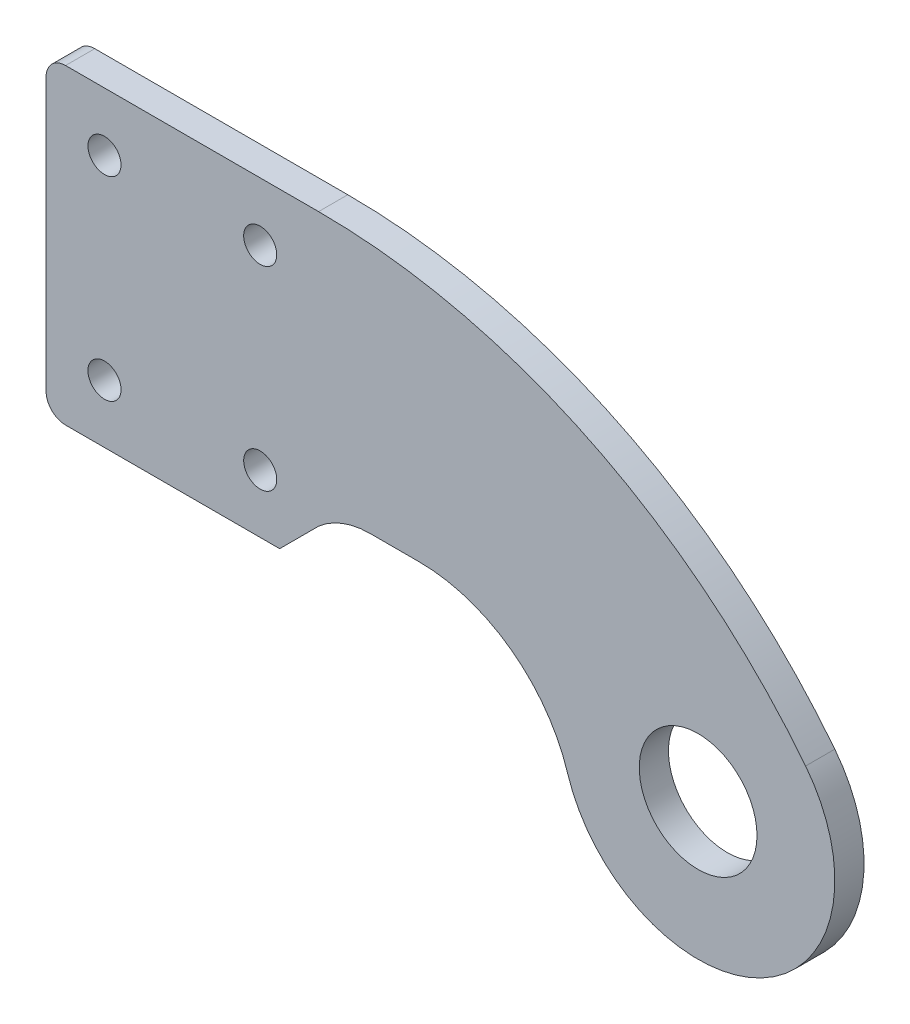
ISO-10303-21;
HEADER;
FILE_DESCRIPTION(('STEP AP214'),'2;1');
FILE_NAME('part.step','',(''),(''),'','','');
FILE_SCHEMA(('AUTOMOTIVE_DESIGN { 1 0 10303 214 1 1 1 1 }'));
ENDSEC;
DATA;
#1=APPLICATION_CONTEXT('core data for automotive mechanical design processes');
#2=APPLICATION_PROTOCOL_DEFINITION('international standard','automotive_design',2000,#1);
#3=PRODUCT_CONTEXT('',#1,'mechanical');
#4=PRODUCT('Part','Part','',(#3));
#5=PRODUCT_RELATED_PRODUCT_CATEGORY('part','',(#4));
#6=PRODUCT_DEFINITION_FORMATION('','',#4);
#7=PRODUCT_DEFINITION_CONTEXT('part definition',#1,'design');
#8=PRODUCT_DEFINITION('design','',#6,#7);
#9=PRODUCT_DEFINITION_SHAPE('','',#8);
#10=(LENGTH_UNIT() NAMED_UNIT(*) SI_UNIT(.MILLI.,.METRE.));
#11=(NAMED_UNIT(*) PLANE_ANGLE_UNIT() SI_UNIT($,.RADIAN.));
#12=(NAMED_UNIT(*) SI_UNIT($,.STERADIAN.) SOLID_ANGLE_UNIT());
#13=UNCERTAINTY_MEASURE_WITH_UNIT(LENGTH_MEASURE(1.E-05),#10,'distance_accuracy_value','');
#14=(GEOMETRIC_REPRESENTATION_CONTEXT(3) GLOBAL_UNCERTAINTY_ASSIGNED_CONTEXT((#13)) GLOBAL_UNIT_ASSIGNED_CONTEXT((#10,
#11,#12)) REPRESENTATION_CONTEXT('',''));
#15=CARTESIAN_POINT('',(0.,0.,0.));
#16=DIRECTION('',(0.,0.,1.));
#17=DIRECTION('',(1.,0.,0.));
#18=AXIS2_PLACEMENT_3D('',#15,#16,#17);
#19=CARTESIAN_POINT('',(0.,0.,0.75));
#20=DIRECTION('',(0.,0.,1.));
#21=DIRECTION('',(1.,0.,0.));
#22=AXIS2_PLACEMENT_3D('',#19,#20,#21);
#23=PLANE('',#22);
#24=DIRECTION('',(1.,0.,0.));
#25=VECTOR('',#24,1.);
#26=CARTESIAN_POINT('',(-33.5,0.5,0.75));
#27=LINE('',#26,#25);
#28=CARTESIAN_POINT('',(-32.5,0.5,0.75));
#29=VERTEX_POINT('',#28);
#30=CARTESIAN_POINT('',(-21.5,0.499999999999999,0.75));
#31=VERTEX_POINT('',#30);
#32=EDGE_CURVE('E118',#29,#31,#27,.T.);
#33=ORIENTED_EDGE('',*,*,#32,.T.);
#34=DIRECTION('',(-0.707106781186548,-0.707106781186548,0.));
#35=VECTOR('',#34,1.);
#36=CARTESIAN_POINT('',(-11.,11.,0.75));
#37=LINE('',#36,#35);
#38=CARTESIAN_POINT('',(-19.5,2.50000000000001,0.75));
#39=VERTEX_POINT('',#38);
#40=EDGE_CURVE('E172',#31,#39,#37,.F.);
#41=ORIENTED_EDGE('',*,*,#40,.T.);
#42=CARTESIAN_POINT('',(-16.8542486889354,-0.500000000000001,0.75));
#43=DIRECTION('',(0.,0.,1.));
#44=DIRECTION('',(1.,0.,0.));
#45=AXIS2_PLACEMENT_3D('',#42,#43,#44);
#46=CIRCLE('',#45,4.);
#47=CARTESIAN_POINT('',(-16.8542486889354,3.5,0.75));
#48=VERTEX_POINT('',#47);
#49=EDGE_CURVE('E183',#39,#48,#46,.F.);
#50=ORIENTED_EDGE('',*,*,#49,.T.);
#51=DIRECTION('',(-1.,0.,0.));
#52=VECTOR('',#51,1.);
#53=CARTESIAN_POINT('',(-19.5,3.5,0.75));
#54=LINE('',#53,#52);
#55=CARTESIAN_POINT('',(-14.3352929861932,3.5,0.75));
#56=VERTEX_POINT('',#55);
#57=EDGE_CURVE('E195',#56,#48,#54,.T.);
#58=ORIENTED_EDGE('',*,*,#57,.F.);
#59=CARTESIAN_POINT('',(-14.3352929861932,-4.5,0.75));
#60=DIRECTION('',(0.,0.,1.));
#61=DIRECTION('',(1.,0.,0.));
#62=AXIS2_PLACEMENT_3D('',#59,#60,#61);
#63=CIRCLE('',#62,8.);
#64=CARTESIAN_POINT('',(-6.70252467407702,-2.10399334442596,0.75));
#65=VERTEX_POINT('',#64);
#66=EDGE_CURVE('E40',#56,#65,#63,.F.);
#67=ORIENTED_EDGE('',*,*,#66,.T.);
#68=CARTESIAN_POINT('',(0.,0.,0.75));
#69=DIRECTION('',(0.,0.,1.));
#70=DIRECTION('',(1.,0.,0.));
#71=AXIS2_PLACEMENT_3D('',#68,#69,#70);
#72=CIRCLE('',#71,7.025);
#73=CARTESIAN_POINT('',(5.52291829833746,4.34142816016679,0.75));
#74=VERTEX_POINT('',#73);
#75=EDGE_CURVE('E110',#65,#74,#72,.T.);
#76=ORIENTED_EDGE('',*,*,#75,.T.);
#77=CARTESIAN_POINT('',(-19.5,-15.328463060686,0.75));
#78=DIRECTION('',(0.,0.,1.));
#79=DIRECTION('',(-1.,0.,0.));
#80=AXIS2_PLACEMENT_3D('',#77,#78,#79);
#81=CIRCLE('',#80,31.828463060686);
#82=CARTESIAN_POINT('',(-19.5,16.5,0.75));
#83=VERTEX_POINT('',#82);
#84=EDGE_CURVE('E116',#74,#83,#81,.T.);
#85=ORIENTED_EDGE('',*,*,#84,.T.);
#86=DIRECTION('',(-1.,0.,0.));
#87=VECTOR('',#86,1.);
#88=CARTESIAN_POINT('',(-33.5,16.5,0.75));
#89=LINE('',#88,#87);
#90=CARTESIAN_POINT('',(-32.5,16.5,0.75));
#91=VERTEX_POINT('',#90);
#92=EDGE_CURVE('E132',#83,#91,#89,.T.);
#93=ORIENTED_EDGE('',*,*,#92,.T.);
#94=CARTESIAN_POINT('',(-32.5,15.5,0.75));
#95=DIRECTION('',(0.,0.,1.));
#96=DIRECTION('',(1.,0.,0.));
#97=AXIS2_PLACEMENT_3D('',#94,#95,#96);
#98=CIRCLE('',#97,1.);
#99=CARTESIAN_POINT('',(-33.5,15.5,0.75));
#100=VERTEX_POINT('',#99);
#101=EDGE_CURVE('E163',#91,#100,#98,.T.);
#102=ORIENTED_EDGE('',*,*,#101,.T.);
#103=DIRECTION('',(0.,-1.,0.));
#104=VECTOR('',#103,1.);
#105=CARTESIAN_POINT('',(-33.5,16.5,0.75));
#106=LINE('',#105,#104);
#107=CARTESIAN_POINT('',(-33.5,1.5,0.75));
#108=VERTEX_POINT('',#107);
#109=EDGE_CURVE('E150',#100,#108,#106,.T.);
#110=ORIENTED_EDGE('',*,*,#109,.T.);
#111=CARTESIAN_POINT('',(-32.5,1.5,0.75));
#112=DIRECTION('',(0.,0.,1.));
#113=DIRECTION('',(1.,0.,0.));
#114=AXIS2_PLACEMENT_3D('',#111,#112,#113);
#115=CIRCLE('',#114,1.);
#116=EDGE_CURVE('E165',#108,#29,#115,.T.);
#117=ORIENTED_EDGE('',*,*,#116,.T.);
#118=EDGE_LOOP('',(#33,#41,#50,#58,#67,#76,#85,#93,#102,#110,#117));
#119=FACE_BOUND('',#118,.T.);
#120=CARTESIAN_POINT('',(-22.5,3.5,0.75));
#121=DIRECTION('',(0.,0.,1.));
#122=DIRECTION('',(1.,0.,0.));
#123=AXIS2_PLACEMENT_3D('',#120,#121,#122);
#124=CIRCLE('',#123,0.85);
#125=CARTESIAN_POINT('',(-21.65,3.5,0.75));
#126=VERTEX_POINT('',#125);
#127=EDGE_CURVE('E210',#126,#126,#124,.T.);
#128=ORIENTED_EDGE('',*,*,#127,.F.);
#129=EDGE_LOOP('',(#128));
#130=FACE_BOUND('',#129,.T.);
#131=CARTESIAN_POINT('',(-30.5,13.5,0.75));
#132=DIRECTION('',(0.,0.,1.));
#133=DIRECTION('',(1.,0.,0.));
#134=AXIS2_PLACEMENT_3D('',#131,#132,#133);
#135=CIRCLE('',#134,0.85);
#136=CARTESIAN_POINT('',(-29.65,13.5,0.75));
#137=VERTEX_POINT('',#136);
#138=EDGE_CURVE('E222',#137,#137,#135,.T.);
#139=ORIENTED_EDGE('',*,*,#138,.F.);
#140=EDGE_LOOP('',(#139));
#141=FACE_BOUND('',#140,.T.);
#142=CARTESIAN_POINT('',(0.,0.,0.75));
#143=DIRECTION('',(0.,0.,1.));
#144=DIRECTION('',(1.,0.,0.));
#145=AXIS2_PLACEMENT_3D('',#142,#143,#144);
#146=CIRCLE('',#145,3.025);
#147=CARTESIAN_POINT('',(3.025,0.,0.75));
#148=VERTEX_POINT('',#147);
#149=EDGE_CURVE('E141',#148,#148,#146,.T.);
#150=ORIENTED_EDGE('',*,*,#149,.F.);
#151=EDGE_LOOP('',(#150));
#152=FACE_BOUND('',#151,.T.);
#153=CARTESIAN_POINT('',(-22.5,13.5,0.75));
#154=DIRECTION('',(0.,0.,1.));
#155=DIRECTION('',(1.,0.,0.));
#156=AXIS2_PLACEMENT_3D('',#153,#154,#155);
#157=CIRCLE('',#156,0.85);
#158=CARTESIAN_POINT('',(-21.65,13.5,0.75));
#159=VERTEX_POINT('',#158);
#160=EDGE_CURVE('E216',#159,#159,#157,.T.);
#161=ORIENTED_EDGE('',*,*,#160,.F.);
#162=EDGE_LOOP('',(#161));
#163=FACE_BOUND('',#162,.T.);
#164=CARTESIAN_POINT('',(-30.5,3.5,0.75));
#165=DIRECTION('',(0.,0.,1.));
#166=DIRECTION('',(1.,0.,0.));
#167=AXIS2_PLACEMENT_3D('',#164,#165,#166);
#168=CIRCLE('',#167,0.85);
#169=CARTESIAN_POINT('',(-29.65,3.5,0.75));
#170=VERTEX_POINT('',#169);
#171=EDGE_CURVE('E204',#170,#170,#168,.T.);
#172=ORIENTED_EDGE('',*,*,#171,.F.);
#173=EDGE_LOOP('',(#172));
#174=FACE_BOUND('',#173,.T.);
#175=ADVANCED_FACE('F32',(#119,#130,#141,#152,#163,#174),#23,.T.);
#176=CARTESIAN_POINT('',(0.,0.,-0.75));
#177=DIRECTION('',(0.,0.,1.));
#178=DIRECTION('',(1.,0.,0.));
#179=AXIS2_PLACEMENT_3D('',#176,#177,#178);
#180=PLANE('',#179);
#181=CARTESIAN_POINT('',(-22.5,3.5,-0.75));
#182=DIRECTION('',(0.,0.,1.));
#183=DIRECTION('',(1.,0.,0.));
#184=AXIS2_PLACEMENT_3D('',#181,#182,#183);
#185=CIRCLE('',#184,0.85);
#186=CARTESIAN_POINT('',(-21.65,3.5,-0.75));
#187=VERTEX_POINT('',#186);
#188=EDGE_CURVE('E207',#187,#187,#185,.T.);
#189=ORIENTED_EDGE('',*,*,#188,.T.);
#190=EDGE_LOOP('',(#189));
#191=FACE_BOUND('',#190,.T.);
#192=CARTESIAN_POINT('',(-30.5,13.5,-0.75));
#193=DIRECTION('',(0.,0.,1.));
#194=DIRECTION('',(1.,0.,0.));
#195=AXIS2_PLACEMENT_3D('',#192,#193,#194);
#196=CIRCLE('',#195,0.85);
#197=CARTESIAN_POINT('',(-29.65,13.5,-0.75));
#198=VERTEX_POINT('',#197);
#199=EDGE_CURVE('E219',#198,#198,#196,.T.);
#200=ORIENTED_EDGE('',*,*,#199,.T.);
#201=EDGE_LOOP('',(#200));
#202=FACE_BOUND('',#201,.T.);
#203=CARTESIAN_POINT('',(0.,0.,-0.75));
#204=DIRECTION('',(0.,0.,1.));
#205=DIRECTION('',(1.,0.,0.));
#206=AXIS2_PLACEMENT_3D('',#203,#204,#205);
#207=CIRCLE('',#206,7.025);
#208=CARTESIAN_POINT('',(-6.70252467407702,-2.10399334442596,-0.75));
#209=VERTEX_POINT('',#208);
#210=CARTESIAN_POINT('',(5.52291829833746,4.34142816016679,-0.75));
#211=VERTEX_POINT('',#210);
#212=EDGE_CURVE('E123',#209,#211,#207,.T.);
#213=ORIENTED_EDGE('',*,*,#212,.F.);
#214=CARTESIAN_POINT('',(-14.3352929861932,-4.5,-0.75));
#215=DIRECTION('',(0.,0.,1.));
#216=DIRECTION('',(1.,0.,0.));
#217=AXIS2_PLACEMENT_3D('',#214,#215,#216);
#218=CIRCLE('',#217,8.);
#219=CARTESIAN_POINT('',(-14.3352929861932,3.5,-0.75));
#220=VERTEX_POINT('',#219);
#221=EDGE_CURVE('E11',#209,#220,#218,.T.);
#222=ORIENTED_EDGE('',*,*,#221,.T.);
#223=DIRECTION('',(-1.,0.,0.));
#224=VECTOR('',#223,1.);
#225=CARTESIAN_POINT('',(-19.5,3.5,-0.75));
#226=LINE('',#225,#224);
#227=CARTESIAN_POINT('',(-16.8542486889354,3.5,-0.75));
#228=VERTEX_POINT('',#227);
#229=EDGE_CURVE('E196',#220,#228,#226,.T.);
#230=ORIENTED_EDGE('',*,*,#229,.T.);
#231=CARTESIAN_POINT('',(-16.8542486889354,-0.500000000000001,-0.75));
#232=DIRECTION('',(0.,0.,1.));
#233=DIRECTION('',(1.,0.,0.));
#234=AXIS2_PLACEMENT_3D('',#231,#232,#233);
#235=CIRCLE('',#234,4.);
#236=CARTESIAN_POINT('',(-19.5,2.50000000000001,-0.75));
#237=VERTEX_POINT('',#236);
#238=EDGE_CURVE('E186',#228,#237,#235,.T.);
#239=ORIENTED_EDGE('',*,*,#238,.T.);
#240=DIRECTION('',(0.707106781186548,0.707106781186548,0.));
#241=VECTOR('',#240,1.);
#242=CARTESIAN_POINT('',(-21.5,0.5,-0.75));
#243=LINE('',#242,#241);
#244=CARTESIAN_POINT('',(-21.5,0.5,-0.75));
#245=VERTEX_POINT('',#244);
#246=EDGE_CURVE('E178',#237,#245,#243,.F.);
#247=ORIENTED_EDGE('',*,*,#246,.T.);
#248=DIRECTION('',(1.,0.,0.));
#249=VECTOR('',#248,1.);
#250=CARTESIAN_POINT('',(-19.5,0.5,-0.75));
#251=LINE('',#250,#249);
#252=CARTESIAN_POINT('',(-32.5,0.5,-0.75));
#253=VERTEX_POINT('',#252);
#254=EDGE_CURVE('E140',#253,#245,#251,.T.);
#255=ORIENTED_EDGE('',*,*,#254,.F.);
#256=CARTESIAN_POINT('',(-32.5,1.5,-0.75));
#257=DIRECTION('',(0.,0.,1.));
#258=DIRECTION('',(1.,0.,0.));
#259=AXIS2_PLACEMENT_3D('',#256,#257,#258);
#260=CIRCLE('',#259,1.);
#261=CARTESIAN_POINT('',(-33.5,1.5,-0.75));
#262=VERTEX_POINT('',#261);
#263=EDGE_CURVE('E156',#253,#262,#260,.F.);
#264=ORIENTED_EDGE('',*,*,#263,.T.);
#265=DIRECTION('',(0.,-1.,0.));
#266=VECTOR('',#265,1.);
#267=CARTESIAN_POINT('',(-33.5,16.5,-0.75));
#268=LINE('',#267,#266);
#269=CARTESIAN_POINT('',(-33.5,15.5,-0.75));
#270=VERTEX_POINT('',#269);
#271=EDGE_CURVE('E137',#270,#262,#268,.T.);
#272=ORIENTED_EDGE('',*,*,#271,.F.);
#273=CARTESIAN_POINT('',(-32.5,15.5,-0.75));
#274=DIRECTION('',(0.,0.,1.));
#275=DIRECTION('',(1.,0.,0.));
#276=AXIS2_PLACEMENT_3D('',#273,#274,#275);
#277=CIRCLE('',#276,1.);
#278=CARTESIAN_POINT('',(-32.5,16.5,-0.75));
#279=VERTEX_POINT('',#278);
#280=EDGE_CURVE('E154',#270,#279,#277,.F.);
#281=ORIENTED_EDGE('',*,*,#280,.T.);
#282=DIRECTION('',(-1.,0.,0.));
#283=VECTOR('',#282,1.);
#284=CARTESIAN_POINT('',(-33.5,16.5,-0.75));
#285=LINE('',#284,#283);
#286=CARTESIAN_POINT('',(-19.5,16.5,-0.75));
#287=VERTEX_POINT('',#286);
#288=EDGE_CURVE('E147',#287,#279,#285,.T.);
#289=ORIENTED_EDGE('',*,*,#288,.F.);
#290=CARTESIAN_POINT('',(-19.5,-15.328463060686,-0.75));
#291=DIRECTION('',(0.,0.,1.));
#292=DIRECTION('',(-1.,0.,0.));
#293=AXIS2_PLACEMENT_3D('',#290,#291,#292);
#294=CIRCLE('',#293,31.828463060686);
#295=EDGE_CURVE('E145',#211,#287,#294,.T.);
#296=ORIENTED_EDGE('',*,*,#295,.F.);
#297=EDGE_LOOP('',(#213,#222,#230,#239,#247,#255,#264,#272,#281,#289,#296));
#298=FACE_BOUND('',#297,.T.);
#299=CARTESIAN_POINT('',(0.,0.,-0.75));
#300=DIRECTION('',(0.,0.,1.));
#301=DIRECTION('',(1.,0.,0.));
#302=AXIS2_PLACEMENT_3D('',#299,#300,#301);
#303=CIRCLE('',#302,3.025);
#304=CARTESIAN_POINT('',(3.025,0.,-0.75));
#305=VERTEX_POINT('',#304);
#306=EDGE_CURVE('E225',#305,#305,#303,.T.);
#307=ORIENTED_EDGE('',*,*,#306,.T.);
#308=EDGE_LOOP('',(#307));
#309=FACE_BOUND('',#308,.T.);
#310=CARTESIAN_POINT('',(-22.5,13.5,-0.75));
#311=DIRECTION('',(0.,0.,1.));
#312=DIRECTION('',(1.,0.,0.));
#313=AXIS2_PLACEMENT_3D('',#310,#311,#312);
#314=CIRCLE('',#313,0.85);
#315=CARTESIAN_POINT('',(-21.65,13.5,-0.75));
#316=VERTEX_POINT('',#315);
#317=EDGE_CURVE('E213',#316,#316,#314,.T.);
#318=ORIENTED_EDGE('',*,*,#317,.T.);
#319=EDGE_LOOP('',(#318));
#320=FACE_BOUND('',#319,.T.);
#321=CARTESIAN_POINT('',(-30.5,3.5,-0.75));
#322=DIRECTION('',(0.,0.,1.));
#323=DIRECTION('',(1.,0.,0.));
#324=AXIS2_PLACEMENT_3D('',#321,#322,#323);
#325=CIRCLE('',#324,0.85);
#326=CARTESIAN_POINT('',(-29.65,3.5,-0.75));
#327=VERTEX_POINT('',#326);
#328=EDGE_CURVE('E201',#327,#327,#325,.T.);
#329=ORIENTED_EDGE('',*,*,#328,.T.);
#330=EDGE_LOOP('',(#329));
#331=FACE_BOUND('',#330,.T.);
#332=ADVANCED_FACE('F246',(#191,#202,#298,#309,#320,#331),#180,.F.);
#333=CARTESIAN_POINT('',(-33.5,16.5,0.75));
#334=DIRECTION('',(1.,0.,0.));
#335=DIRECTION('',(0.,1.,0.));
#336=AXIS2_PLACEMENT_3D('',#333,#334,#335);
#337=PLANE('',#336);
#338=ORIENTED_EDGE('',*,*,#271,.T.);
#339=DIRECTION('',(0.,0.,-1.));
#340=VECTOR('',#339,1.);
#341=CARTESIAN_POINT('',(-33.5,1.5,0.75));
#342=LINE('',#341,#340);
#343=EDGE_CURVE('E161',#262,#108,#342,.F.);
#344=ORIENTED_EDGE('',*,*,#343,.T.);
#345=ORIENTED_EDGE('',*,*,#109,.F.);
#346=DIRECTION('',(0.,0.,-1.));
#347=VECTOR('',#346,1.);
#348=CARTESIAN_POINT('',(-33.5,15.5,0.75));
#349=LINE('',#348,#347);
#350=EDGE_CURVE('E158',#100,#270,#349,.T.);
#351=ORIENTED_EDGE('',*,*,#350,.T.);
#352=EDGE_LOOP('',(#338,#344,#345,#351));
#353=FACE_BOUND('',#352,.T.);
#354=ADVANCED_FACE('F249',(#353),#337,.F.);
#355=CARTESIAN_POINT('',(-19.5,0.5,0.75));
#356=DIRECTION('',(0.,1.,0.));
#357=DIRECTION('',(-1.,0.,0.));
#358=AXIS2_PLACEMENT_3D('',#355,#356,#357);
#359=PLANE('',#358);
#360=ORIENTED_EDGE('',*,*,#254,.T.);
#361=DIRECTION('',(0.,0.,1.));
#362=VECTOR('',#361,1.);
#363=CARTESIAN_POINT('',(-21.5,0.5,0.75));
#364=LINE('',#363,#362);
#365=EDGE_CURVE('E169',#245,#31,#364,.T.);
#366=ORIENTED_EDGE('',*,*,#365,.T.);
#367=ORIENTED_EDGE('',*,*,#32,.F.);
#368=DIRECTION('',(0.,0.,-1.));
#369=VECTOR('',#368,1.);
#370=CARTESIAN_POINT('',(-32.5,0.5,0.75));
#371=LINE('',#370,#369);
#372=EDGE_CURVE('E126',#29,#253,#371,.T.);
#373=ORIENTED_EDGE('',*,*,#372,.T.);
#374=EDGE_LOOP('',(#360,#366,#367,#373));
#375=FACE_BOUND('',#374,.T.);
#376=ADVANCED_FACE('F238',(#375),#359,.F.);
#377=CARTESIAN_POINT('',(0.,0.,0.75));
#378=DIRECTION('',(0.,0.,-1.));
#379=DIRECTION('',(-1.,0.,0.));
#380=AXIS2_PLACEMENT_3D('',#377,#378,#379);
#381=CYLINDRICAL_SURFACE('',#380,7.025);
#382=ORIENTED_EDGE('',*,*,#75,.F.);
#383=DIRECTION('',(0.,0.,-1.));
#384=VECTOR('',#383,1.);
#385=CARTESIAN_POINT('',(-6.70252467407702,-2.10399334442596,0.75));
#386=LINE('',#385,#384);
#387=EDGE_CURVE('E53',#65,#209,#386,.T.);
#388=ORIENTED_EDGE('',*,*,#387,.T.);
#389=ORIENTED_EDGE('',*,*,#212,.T.);
#390=DIRECTION('',(0.,0.,-1.));
#391=VECTOR('',#390,1.);
#392=CARTESIAN_POINT('',(5.52291829833746,4.34142816016679,0.75));
#393=LINE('',#392,#391);
#394=EDGE_CURVE('E121',#74,#211,#393,.T.);
#395=ORIENTED_EDGE('',*,*,#394,.F.);
#396=EDGE_LOOP('',(#382,#388,#389,#395));
#397=FACE_BOUND('',#396,.T.);
#398=ADVANCED_FACE('F122',(#397),#381,.T.);
#399=CARTESIAN_POINT('',(-19.5,-15.328463060686,0.75));
#400=DIRECTION('',(0.,0.,-1.));
#401=DIRECTION('',(-1.,0.,0.));
#402=AXIS2_PLACEMENT_3D('',#399,#400,#401);
#403=CYLINDRICAL_SURFACE('',#402,31.828463060686);
#404=ORIENTED_EDGE('',*,*,#295,.T.);
#405=DIRECTION('',(0.,0.,-1.));
#406=VECTOR('',#405,1.);
#407=CARTESIAN_POINT('',(-19.5,16.5,0.75));
#408=LINE('',#407,#406);
#409=EDGE_CURVE('E127',#83,#287,#408,.T.);
#410=ORIENTED_EDGE('',*,*,#409,.F.);
#411=ORIENTED_EDGE('',*,*,#84,.F.);
#412=ORIENTED_EDGE('',*,*,#394,.T.);
#413=EDGE_LOOP('',(#404,#410,#411,#412));
#414=FACE_BOUND('',#413,.T.);
#415=ADVANCED_FACE('F129',(#414),#403,.T.);
#416=CARTESIAN_POINT('',(-33.5,16.5,0.75));
#417=DIRECTION('',(0.,-1.,0.));
#418=DIRECTION('',(0.,0.,-1.));
#419=AXIS2_PLACEMENT_3D('',#416,#417,#418);
#420=PLANE('',#419);
#421=ORIENTED_EDGE('',*,*,#288,.T.);
#422=DIRECTION('',(0.,0.,-1.));
#423=VECTOR('',#422,1.);
#424=CARTESIAN_POINT('',(-32.5,16.5,0.75));
#425=LINE('',#424,#423);
#426=EDGE_CURVE('E167',#279,#91,#425,.F.);
#427=ORIENTED_EDGE('',*,*,#426,.T.);
#428=ORIENTED_EDGE('',*,*,#92,.F.);
#429=ORIENTED_EDGE('',*,*,#409,.T.);
#430=EDGE_LOOP('',(#421,#427,#428,#429));
#431=FACE_BOUND('',#430,.T.);
#432=ADVANCED_FACE('F258',(#431),#420,.F.);
#433=CARTESIAN_POINT('',(0.,0.,0.75));
#434=DIRECTION('',(0.,0.,-1.));
#435=DIRECTION('',(-1.,0.,0.));
#436=AXIS2_PLACEMENT_3D('',#433,#434,#435);
#437=CYLINDRICAL_SURFACE('',#436,3.025);
#438=ORIENTED_EDGE('',*,*,#149,.T.);
#439=EDGE_LOOP('',(#438));
#440=FACE_BOUND('',#439,.T.);
#441=ORIENTED_EDGE('',*,*,#306,.F.);
#442=EDGE_LOOP('',(#441));
#443=FACE_BOUND('',#442,.T.);
#444=ADVANCED_FACE('F260',(#440,#443),#437,.F.);
#445=CARTESIAN_POINT('',(-30.5,13.5,0.75));
#446=DIRECTION('',(0.,0.,-1.));
#447=DIRECTION('',(-1.,0.,0.));
#448=AXIS2_PLACEMENT_3D('',#445,#446,#447);
#449=CYLINDRICAL_SURFACE('',#448,0.85);
#450=ORIENTED_EDGE('',*,*,#138,.T.);
#451=EDGE_LOOP('',(#450));
#452=FACE_BOUND('',#451,.T.);
#453=ORIENTED_EDGE('',*,*,#199,.F.);
#454=EDGE_LOOP('',(#453));
#455=FACE_BOUND('',#454,.T.);
#456=ADVANCED_FACE('F266',(#452,#455),#449,.F.);
#457=CARTESIAN_POINT('',(-22.5,13.5,0.75));
#458=DIRECTION('',(0.,0.,-1.));
#459=DIRECTION('',(-1.,0.,0.));
#460=AXIS2_PLACEMENT_3D('',#457,#458,#459);
#461=CYLINDRICAL_SURFACE('',#460,0.85);
#462=ORIENTED_EDGE('',*,*,#160,.T.);
#463=EDGE_LOOP('',(#462));
#464=FACE_BOUND('',#463,.T.);
#465=ORIENTED_EDGE('',*,*,#317,.F.);
#466=EDGE_LOOP('',(#465));
#467=FACE_BOUND('',#466,.T.);
#468=ADVANCED_FACE('F280',(#464,#467),#461,.F.);
#469=CARTESIAN_POINT('',(-22.5,3.5,0.75));
#470=DIRECTION('',(0.,0.,-1.));
#471=DIRECTION('',(-1.,0.,0.));
#472=AXIS2_PLACEMENT_3D('',#469,#470,#471);
#473=CYLINDRICAL_SURFACE('',#472,0.85);
#474=ORIENTED_EDGE('',*,*,#127,.T.);
#475=EDGE_LOOP('',(#474));
#476=FACE_BOUND('',#475,.T.);
#477=ORIENTED_EDGE('',*,*,#188,.F.);
#478=EDGE_LOOP('',(#477));
#479=FACE_BOUND('',#478,.T.);
#480=ADVANCED_FACE('F284',(#476,#479),#473,.F.);
#481=CARTESIAN_POINT('',(-30.5,3.5,0.75));
#482=DIRECTION('',(0.,0.,-1.));
#483=DIRECTION('',(-1.,0.,0.));
#484=AXIS2_PLACEMENT_3D('',#481,#482,#483);
#485=CYLINDRICAL_SURFACE('',#484,0.85);
#486=ORIENTED_EDGE('',*,*,#171,.T.);
#487=EDGE_LOOP('',(#486));
#488=FACE_BOUND('',#487,.T.);
#489=ORIENTED_EDGE('',*,*,#328,.F.);
#490=EDGE_LOOP('',(#489));
#491=FACE_BOUND('',#490,.T.);
#492=ADVANCED_FACE('F288',(#488,#491),#485,.F.);
#493=CARTESIAN_POINT('',(-32.5,1.5,0.75));
#494=DIRECTION('',(0.,0.,-1.));
#495=DIRECTION('',(-1.,0.,0.));
#496=AXIS2_PLACEMENT_3D('',#493,#494,#495);
#497=CYLINDRICAL_SURFACE('',#496,1.);
#498=ORIENTED_EDGE('',*,*,#116,.F.);
#499=ORIENTED_EDGE('',*,*,#343,.F.);
#500=ORIENTED_EDGE('',*,*,#263,.F.);
#501=ORIENTED_EDGE('',*,*,#372,.F.);
#502=EDGE_LOOP('',(#498,#499,#500,#501));
#503=FACE_BOUND('',#502,.T.);
#504=ADVANCED_FACE('F242',(#503),#497,.T.);
#505=CARTESIAN_POINT('',(-32.5,15.5,0.75));
#506=DIRECTION('',(0.,0.,-1.));
#507=DIRECTION('',(-1.,0.,0.));
#508=AXIS2_PLACEMENT_3D('',#505,#506,#507);
#509=CYLINDRICAL_SURFACE('',#508,1.);
#510=ORIENTED_EDGE('',*,*,#101,.F.);
#511=ORIENTED_EDGE('',*,*,#426,.F.);
#512=ORIENTED_EDGE('',*,*,#280,.F.);
#513=ORIENTED_EDGE('',*,*,#350,.F.);
#514=EDGE_LOOP('',(#510,#511,#512,#513));
#515=FACE_BOUND('',#514,.T.);
#516=ADVANCED_FACE('F254',(#515),#509,.T.);
#517=CARTESIAN_POINT('',(-19.5,3.5,-0.75));
#518=DIRECTION('',(0.,1.,0.));
#519=DIRECTION('',(0.,0.,1.));
#520=AXIS2_PLACEMENT_3D('',#517,#518,#519);
#521=PLANE('',#520);
#522=ORIENTED_EDGE('',*,*,#229,.F.);
#523=DIRECTION('',(0.,0.,1.));
#524=VECTOR('',#523,1.);
#525=CARTESIAN_POINT('',(-14.3352929861932,3.5,0.75));
#526=LINE('',#525,#524);
#527=EDGE_CURVE('E188',#220,#56,#526,.T.);
#528=ORIENTED_EDGE('',*,*,#527,.T.);
#529=ORIENTED_EDGE('',*,*,#57,.T.);
#530=DIRECTION('',(0.,0.,-1.));
#531=VECTOR('',#530,1.);
#532=CARTESIAN_POINT('',(-16.8542486889354,3.5,-0.75));
#533=LINE('',#532,#531);
#534=EDGE_CURVE('E180',#48,#228,#533,.T.);
#535=ORIENTED_EDGE('',*,*,#534,.T.);
#536=EDGE_LOOP('',(#522,#528,#529,#535));
#537=FACE_BOUND('',#536,.T.);
#538=ADVANCED_FACE('F194',(#537),#521,.F.);
#539=CARTESIAN_POINT('',(-21.5,0.5,0.75));
#540=DIRECTION('',(-0.707106781186548,0.707106781186548,0.));
#541=DIRECTION('',(-0.707106781186548,-0.707106781186548,0.));
#542=AXIS2_PLACEMENT_3D('',#539,#540,#541);
#543=PLANE('',#542);
#544=ORIENTED_EDGE('',*,*,#246,.F.);
#545=DIRECTION('',(0.,0.,-1.));
#546=VECTOR('',#545,1.);
#547=CARTESIAN_POINT('',(-19.5,2.50000000000001,-0.75));
#548=LINE('',#547,#546);
#549=EDGE_CURVE('E175',#39,#237,#548,.T.);
#550=ORIENTED_EDGE('',*,*,#549,.F.);
#551=ORIENTED_EDGE('',*,*,#40,.F.);
#552=ORIENTED_EDGE('',*,*,#365,.F.);
#553=EDGE_LOOP('',(#544,#550,#551,#552));
#554=FACE_BOUND('',#553,.T.);
#555=ADVANCED_FACE('F294',(#554),#543,.F.);
#556=CARTESIAN_POINT('',(-16.8542486889354,-0.500000000000001,-0.75));
#557=DIRECTION('',(0.,0.,-1.));
#558=DIRECTION('',(-1.,0.,0.));
#559=AXIS2_PLACEMENT_3D('',#556,#557,#558);
#560=CYLINDRICAL_SURFACE('',#559,4.);
#561=ORIENTED_EDGE('',*,*,#238,.F.);
#562=ORIENTED_EDGE('',*,*,#534,.F.);
#563=ORIENTED_EDGE('',*,*,#49,.F.);
#564=ORIENTED_EDGE('',*,*,#549,.T.);
#565=EDGE_LOOP('',(#561,#562,#563,#564));
#566=FACE_BOUND('',#565,.T.);
#567=ADVANCED_FACE('F299',(#566),#560,.F.);
#568=CARTESIAN_POINT('',(-14.3352929861932,-4.5,0.75));
#569=DIRECTION('',(0.,0.,-1.));
#570=DIRECTION('',(-1.,0.,0.));
#571=AXIS2_PLACEMENT_3D('',#568,#569,#570);
#572=CYLINDRICAL_SURFACE('',#571,8.);
#573=ORIENTED_EDGE('',*,*,#221,.F.);
#574=ORIENTED_EDGE('',*,*,#387,.F.);
#575=ORIENTED_EDGE('',*,*,#66,.F.);
#576=ORIENTED_EDGE('',*,*,#527,.F.);
#577=EDGE_LOOP('',(#573,#574,#575,#576));
#578=FACE_BOUND('',#577,.T.);
#579=ADVANCED_FACE('F34',(#578),#572,.F.);
#580=CLOSED_SHELL('',(#175,#332,#354,#376,#398,#415,#432,#444,#456,#468,#480,#492,#504,#516,
#538,#555,#567,#579));
#581=MANIFOLD_SOLID_BREP('B2',#580);
#582=ADVANCED_BREP_SHAPE_REPRESENTATION('',(#18,#581),#14);
#583=SHAPE_DEFINITION_REPRESENTATION(#9,#582);
ENDSEC;
END-ISO-10303-21;
